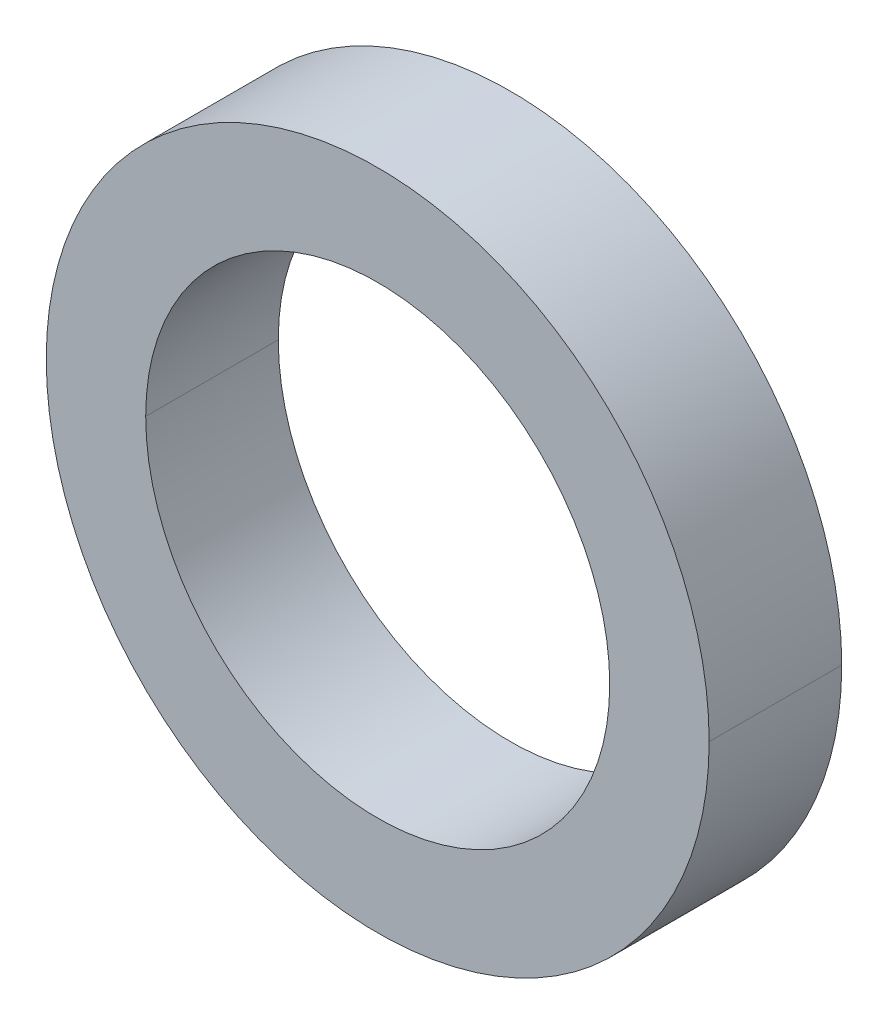
ISO-10303-21;
HEADER;
FILE_DESCRIPTION(('STEP AP214'),'2;1');
FILE_NAME('part.step','',(''),(''),'','','');
FILE_SCHEMA(('AUTOMOTIVE_DESIGN { 1 0 10303 214 1 1 1 1 }'));
ENDSEC;
DATA;
#1=APPLICATION_CONTEXT('core data for automotive mechanical design processes');
#2=APPLICATION_PROTOCOL_DEFINITION('international standard','automotive_design',2000,#1);
#3=PRODUCT_CONTEXT('',#1,'mechanical');
#4=PRODUCT('Part','Part','',(#3));
#5=PRODUCT_RELATED_PRODUCT_CATEGORY('part','',(#4));
#6=PRODUCT_DEFINITION_FORMATION('','',#4);
#7=PRODUCT_DEFINITION_CONTEXT('part definition',#1,'design');
#8=PRODUCT_DEFINITION('design','',#6,#7);
#9=PRODUCT_DEFINITION_SHAPE('','',#8);
#10=(LENGTH_UNIT() NAMED_UNIT(*) SI_UNIT(.MILLI.,.METRE.));
#11=(NAMED_UNIT(*) PLANE_ANGLE_UNIT() SI_UNIT($,.RADIAN.));
#12=(NAMED_UNIT(*) SI_UNIT($,.STERADIAN.) SOLID_ANGLE_UNIT());
#13=UNCERTAINTY_MEASURE_WITH_UNIT(LENGTH_MEASURE(1.E-05),#10,'distance_accuracy_value','');
#14=(GEOMETRIC_REPRESENTATION_CONTEXT(3) GLOBAL_UNCERTAINTY_ASSIGNED_CONTEXT((#13)) GLOBAL_UNIT_ASSIGNED_CONTEXT((#10,
#11,#12)) REPRESENTATION_CONTEXT('',''));
#15=CARTESIAN_POINT('',(0.,0.,0.));
#16=DIRECTION('',(0.,0.,1.));
#17=DIRECTION('',(1.,0.,0.));
#18=AXIS2_PLACEMENT_3D('',#15,#16,#17);
#19=CARTESIAN_POINT('',(0.,0.,1.5875));
#20=DIRECTION('',(0.,0.,-1.));
#21=DIRECTION('',(-1.,0.,0.));
#22=AXIS2_PLACEMENT_3D('',#19,#20,#21);
#23=CYLINDRICAL_SURFACE('',#22,5.55625);
#24=CARTESIAN_POINT('',(0.,0.,1.5875));
#25=DIRECTION('',(0.,0.,1.));
#26=DIRECTION('',(1.,0.,0.));
#27=AXIS2_PLACEMENT_3D('',#24,#25,#26);
#28=CIRCLE('',#27,5.55625);
#29=CARTESIAN_POINT('',(-5.55625,0.,1.5875));
#30=VERTEX_POINT('',#29);
#31=CARTESIAN_POINT('',(5.55625,0.,1.5875));
#32=VERTEX_POINT('',#31);
#33=EDGE_CURVE('E11',#30,#32,#28,.T.);
#34=ORIENTED_EDGE('',*,*,#33,.T.);
#35=DIRECTION('',(0.,0.,-1.));
#36=VECTOR('',#35,1.);
#37=CARTESIAN_POINT('',(5.55625,0.,1.5875));
#38=LINE('',#37,#36);
#39=CARTESIAN_POINT('',(5.55625,0.,-1.5875));
#40=VERTEX_POINT('',#39);
#41=EDGE_CURVE('E27',#32,#40,#38,.T.);
#42=ORIENTED_EDGE('',*,*,#41,.T.);
#43=CARTESIAN_POINT('',(0.,0.,-1.5875));
#44=DIRECTION('',(0.,0.,1.));
#45=DIRECTION('',(1.,0.,0.));
#46=AXIS2_PLACEMENT_3D('',#43,#44,#45);
#47=CIRCLE('',#46,5.55625);
#48=CARTESIAN_POINT('',(-5.55625,0.,-1.5875));
#49=VERTEX_POINT('',#48);
#50=EDGE_CURVE('E85',#49,#40,#47,.T.);
#51=ORIENTED_EDGE('',*,*,#50,.F.);
#52=DIRECTION('',(0.,0.,-1.));
#53=VECTOR('',#52,1.);
#54=CARTESIAN_POINT('',(-5.55625,0.,1.5875));
#55=LINE('',#54,#53);
#56=EDGE_CURVE('E98',#30,#49,#55,.T.);
#57=ORIENTED_EDGE('',*,*,#56,.F.);
#58=EDGE_LOOP('',(#34,#42,#51,#57));
#59=FACE_BOUND('',#58,.T.);
#60=ADVANCED_FACE('F16',(#59),#23,.F.);
#61=CARTESIAN_POINT('',(0.,0.,1.5875));
#62=DIRECTION('',(0.,0.,-1.));
#63=DIRECTION('',(-1.,0.,0.));
#64=AXIS2_PLACEMENT_3D('',#61,#62,#63);
#65=CYLINDRICAL_SURFACE('',#64,7.9375);
#66=CARTESIAN_POINT('',(0.,0.,1.5875));
#67=DIRECTION('',(0.,0.,1.));
#68=DIRECTION('',(1.,0.,0.));
#69=AXIS2_PLACEMENT_3D('',#66,#67,#68);
#70=CIRCLE('',#69,7.9375);
#71=CARTESIAN_POINT('',(7.9375,0.,1.5875));
#72=VERTEX_POINT('',#71);
#73=CARTESIAN_POINT('',(-7.9375,0.,1.5875));
#74=VERTEX_POINT('',#73);
#75=EDGE_CURVE('E68',#72,#74,#70,.T.);
#76=ORIENTED_EDGE('',*,*,#75,.F.);
#77=DIRECTION('',(0.,0.,-1.));
#78=VECTOR('',#77,1.);
#79=CARTESIAN_POINT('',(7.9375,0.,1.5875));
#80=LINE('',#79,#78);
#81=CARTESIAN_POINT('',(7.9375,0.,-1.5875));
#82=VERTEX_POINT('',#81);
#83=EDGE_CURVE('E87',#72,#82,#80,.T.);
#84=ORIENTED_EDGE('',*,*,#83,.T.);
#85=CARTESIAN_POINT('',(0.,0.,-1.5875));
#86=DIRECTION('',(0.,0.,1.));
#87=DIRECTION('',(1.,0.,0.));
#88=AXIS2_PLACEMENT_3D('',#85,#86,#87);
#89=CIRCLE('',#88,7.9375);
#90=CARTESIAN_POINT('',(-7.9375,0.,-1.5875));
#91=VERTEX_POINT('',#90);
#92=EDGE_CURVE('E71',#82,#91,#89,.T.);
#93=ORIENTED_EDGE('',*,*,#92,.T.);
#94=DIRECTION('',(0.,0.,-1.));
#95=VECTOR('',#94,1.);
#96=CARTESIAN_POINT('',(-7.9375,0.,1.5875));
#97=LINE('',#96,#95);
#98=EDGE_CURVE('E64',#74,#91,#97,.T.);
#99=ORIENTED_EDGE('',*,*,#98,.F.);
#100=EDGE_LOOP('',(#76,#84,#93,#99));
#101=FACE_BOUND('',#100,.T.);
#102=ADVANCED_FACE('F66',(#101),#65,.T.);
#103=CARTESIAN_POINT('',(0.,0.,1.5875));
#104=DIRECTION('',(0.,0.,1.));
#105=DIRECTION('',(1.,0.,0.));
#106=AXIS2_PLACEMENT_3D('',#103,#104,#105);
#107=PLANE('',#106);
#108=CARTESIAN_POINT('',(0.,0.,1.5875));
#109=DIRECTION('',(0.,0.,1.));
#110=DIRECTION('',(1.,0.,0.));
#111=AXIS2_PLACEMENT_3D('',#108,#109,#110);
#112=CIRCLE('',#111,7.9375);
#113=EDGE_CURVE('E83',#74,#72,#112,.T.);
#114=ORIENTED_EDGE('',*,*,#113,.T.);
#115=ORIENTED_EDGE('',*,*,#75,.T.);
#116=EDGE_LOOP('',(#114,#115));
#117=FACE_BOUND('',#116,.T.);
#118=ORIENTED_EDGE('',*,*,#33,.F.);
#119=CARTESIAN_POINT('',(0.,0.,1.5875));
#120=DIRECTION('',(0.,0.,1.));
#121=DIRECTION('',(1.,0.,0.));
#122=AXIS2_PLACEMENT_3D('',#119,#120,#121);
#123=CIRCLE('',#122,5.55625);
#124=EDGE_CURVE('E96',#32,#30,#123,.T.);
#125=ORIENTED_EDGE('',*,*,#124,.F.);
#126=EDGE_LOOP('',(#118,#125));
#127=FACE_BOUND('',#126,.T.);
#128=ADVANCED_FACE('F81',(#117,#127),#107,.T.);
#129=CARTESIAN_POINT('',(0.,0.,-1.5875));
#130=DIRECTION('',(0.,0.,1.));
#131=DIRECTION('',(1.,0.,0.));
#132=AXIS2_PLACEMENT_3D('',#129,#130,#131);
#133=PLANE('',#132);
#134=CARTESIAN_POINT('',(0.,0.,-1.5875));
#135=DIRECTION('',(0.,0.,1.));
#136=DIRECTION('',(1.,0.,0.));
#137=AXIS2_PLACEMENT_3D('',#134,#135,#136);
#138=CIRCLE('',#137,7.9375);
#139=EDGE_CURVE('E20',#91,#82,#138,.T.);
#140=ORIENTED_EDGE('',*,*,#139,.F.);
#141=ORIENTED_EDGE('',*,*,#92,.F.);
#142=EDGE_LOOP('',(#140,#141));
#143=FACE_BOUND('',#142,.T.);
#144=ORIENTED_EDGE('',*,*,#50,.T.);
#145=CARTESIAN_POINT('',(0.,0.,-1.5875));
#146=DIRECTION('',(0.,0.,1.));
#147=DIRECTION('',(1.,0.,0.));
#148=AXIS2_PLACEMENT_3D('',#145,#146,#147);
#149=CIRCLE('',#148,5.55625);
#150=EDGE_CURVE('E77',#40,#49,#149,.T.);
#151=ORIENTED_EDGE('',*,*,#150,.T.);
#152=EDGE_LOOP('',(#144,#151));
#153=FACE_BOUND('',#152,.T.);
#154=ADVANCED_FACE('F114',(#143,#153),#133,.F.);
#155=CARTESIAN_POINT('',(0.,0.,1.5875));
#156=DIRECTION('',(0.,0.,-1.));
#157=DIRECTION('',(-1.,0.,0.));
#158=AXIS2_PLACEMENT_3D('',#155,#156,#157);
#159=CYLINDRICAL_SURFACE('',#158,7.9375);
#160=ORIENTED_EDGE('',*,*,#83,.F.);
#161=ORIENTED_EDGE('',*,*,#113,.F.);
#162=ORIENTED_EDGE('',*,*,#98,.T.);
#163=ORIENTED_EDGE('',*,*,#139,.T.);
#164=EDGE_LOOP('',(#160,#161,#162,#163));
#165=FACE_BOUND('',#164,.T.);
#166=ADVANCED_FACE('F18',(#165),#159,.T.);
#167=CARTESIAN_POINT('',(0.,0.,1.5875));
#168=DIRECTION('',(0.,0.,-1.));
#169=DIRECTION('',(-1.,0.,0.));
#170=AXIS2_PLACEMENT_3D('',#167,#168,#169);
#171=CYLINDRICAL_SURFACE('',#170,5.55625);
#172=ORIENTED_EDGE('',*,*,#41,.F.);
#173=ORIENTED_EDGE('',*,*,#124,.T.);
#174=ORIENTED_EDGE('',*,*,#56,.T.);
#175=ORIENTED_EDGE('',*,*,#150,.F.);
#176=EDGE_LOOP('',(#172,#173,#174,#175));
#177=FACE_BOUND('',#176,.T.);
#178=ADVANCED_FACE('F109',(#177),#171,.F.);
#179=CLOSED_SHELL('',(#60,#102,#128,#154,#166,#178));
#180=MANIFOLD_SOLID_BREP('B1',#179);
#181=ADVANCED_BREP_SHAPE_REPRESENTATION('',(#18,#180),#14);
#182=SHAPE_DEFINITION_REPRESENTATION(#9,#181);
ENDSEC;
END-ISO-10303-21;
